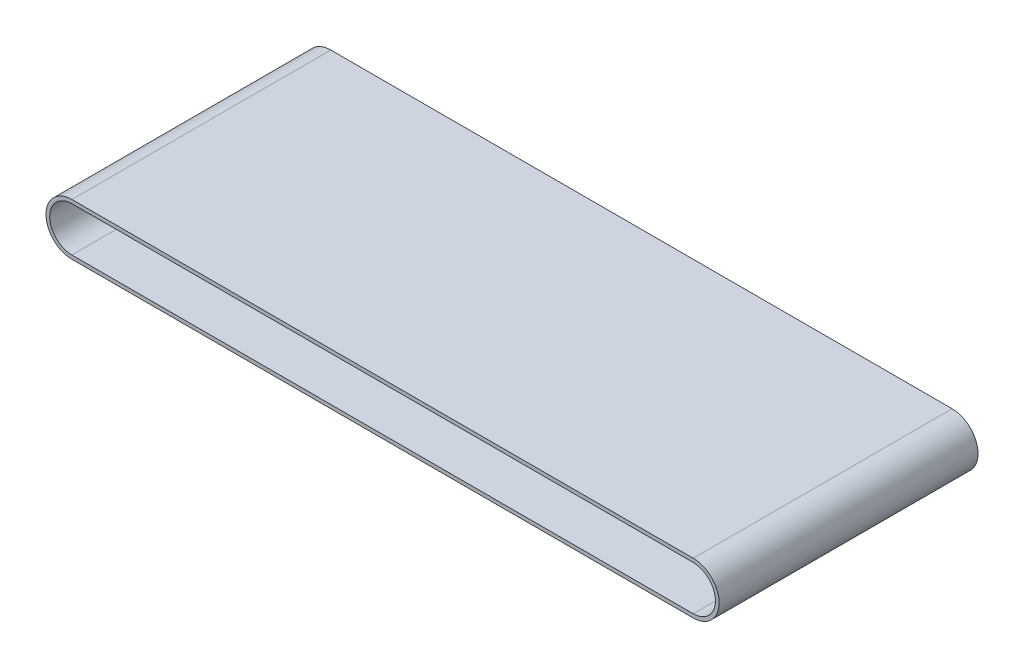
ISO-10303-21;
HEADER;
FILE_DESCRIPTION(('STEP AP214'),'2;1');
FILE_NAME('part.step','',(''),(''),'','','');
FILE_SCHEMA(('AUTOMOTIVE_DESIGN { 1 0 10303 214 1 1 1 1 }'));
ENDSEC;
DATA;
#1=APPLICATION_CONTEXT('core data for automotive mechanical design processes');
#2=APPLICATION_PROTOCOL_DEFINITION('international standard','automotive_design',2000,#1);
#3=PRODUCT_CONTEXT('',#1,'mechanical');
#4=PRODUCT('Part','Part','',(#3));
#5=PRODUCT_RELATED_PRODUCT_CATEGORY('part','',(#4));
#6=PRODUCT_DEFINITION_FORMATION('','',#4);
#7=PRODUCT_DEFINITION_CONTEXT('part definition',#1,'design');
#8=PRODUCT_DEFINITION('design','',#6,#7);
#9=PRODUCT_DEFINITION_SHAPE('','',#8);
#10=(LENGTH_UNIT() NAMED_UNIT(*) SI_UNIT(.MILLI.,.METRE.));
#11=(NAMED_UNIT(*) PLANE_ANGLE_UNIT() SI_UNIT($,.RADIAN.));
#12=(NAMED_UNIT(*) SI_UNIT($,.STERADIAN.) SOLID_ANGLE_UNIT());
#13=UNCERTAINTY_MEASURE_WITH_UNIT(LENGTH_MEASURE(1.E-05),#10,'distance_accuracy_value','');
#14=(GEOMETRIC_REPRESENTATION_CONTEXT(3) GLOBAL_UNCERTAINTY_ASSIGNED_CONTEXT((#13)) GLOBAL_UNIT_ASSIGNED_CONTEXT((#10,
#11,#12)) REPRESENTATION_CONTEXT('',''));
#15=CARTESIAN_POINT('',(0.,0.,0.));
#16=DIRECTION('',(0.,0.,1.));
#17=DIRECTION('',(1.,0.,0.));
#18=AXIS2_PLACEMENT_3D('',#15,#16,#17);
#19=CARTESIAN_POINT('',(0.,0.,222.25));
#20=DIRECTION('',(0.,0.,-1.));
#21=DIRECTION('',(-1.,0.,0.));
#22=AXIS2_PLACEMENT_3D('',#19,#20,#21);
#23=CYLINDRICAL_SURFACE('',#22,44.45);
#24=CARTESIAN_POINT('',(0.,0.,-222.25));
#25=DIRECTION('',(0.,0.,1.));
#26=DIRECTION('',(1.,0.,0.));
#27=AXIS2_PLACEMENT_3D('',#24,#25,#26);
#28=CIRCLE('',#27,44.45);
#29=CARTESIAN_POINT('',(0.,44.45,-222.25));
#30=VERTEX_POINT('',#29);
#31=CARTESIAN_POINT('',(0.,-44.45,-222.25));
#32=VERTEX_POINT('',#31);
#33=EDGE_CURVE('E153',#30,#32,#28,.T.);
#34=ORIENTED_EDGE('',*,*,#33,.T.);
#35=DIRECTION('',(0.,0.,-1.));
#36=VECTOR('',#35,1.);
#37=CARTESIAN_POINT('',(0.,-44.45,222.25));
#38=LINE('',#37,#36);
#39=CARTESIAN_POINT('',(0.,-44.45,222.25));
#40=VERTEX_POINT('',#39);
#41=EDGE_CURVE('E11',#40,#32,#38,.T.);
#42=ORIENTED_EDGE('',*,*,#41,.F.);
#43=CARTESIAN_POINT('',(0.,0.,222.25));
#44=DIRECTION('',(0.,0.,1.));
#45=DIRECTION('',(1.,0.,0.));
#46=AXIS2_PLACEMENT_3D('',#43,#44,#45);
#47=CIRCLE('',#46,44.45);
#48=CARTESIAN_POINT('',(0.,44.45,222.25));
#49=VERTEX_POINT('',#48);
#50=EDGE_CURVE('E159',#49,#40,#47,.T.);
#51=ORIENTED_EDGE('',*,*,#50,.F.);
#52=DIRECTION('',(0.,0.,-1.));
#53=VECTOR('',#52,1.);
#54=CARTESIAN_POINT('',(0.,44.45,222.25));
#55=LINE('',#54,#53);
#56=EDGE_CURVE('E173',#49,#30,#55,.T.);
#57=ORIENTED_EDGE('',*,*,#56,.T.);
#58=EDGE_LOOP('',(#34,#42,#51,#57));
#59=FACE_BOUND('',#58,.T.);
#60=ADVANCED_FACE('F45',(#59),#23,.T.);
#61=CARTESIAN_POINT('',(0.,-44.45,222.25));
#62=DIRECTION('',(0.,1.,0.));
#63=DIRECTION('',(0.,0.,1.));
#64=AXIS2_PLACEMENT_3D('',#61,#62,#63);
#65=PLANE('',#64);
#66=DIRECTION('',(1.,0.,0.));
#67=VECTOR('',#66,1.);
#68=CARTESIAN_POINT('',(0.,-44.45,-222.25));
#69=LINE('',#68,#67);
#70=CARTESIAN_POINT('',(1066.8,-44.45,-222.25));
#71=VERTEX_POINT('',#70);
#72=EDGE_CURVE('E177',#32,#71,#69,.T.);
#73=ORIENTED_EDGE('',*,*,#72,.T.);
#74=DIRECTION('',(0.,0.,-1.));
#75=VECTOR('',#74,1.);
#76=CARTESIAN_POINT('',(1066.8,-44.45,222.25));
#77=LINE('',#76,#75);
#78=CARTESIAN_POINT('',(1066.8,-44.45,222.25));
#79=VERTEX_POINT('',#78);
#80=EDGE_CURVE('E53',#79,#71,#77,.T.);
#81=ORIENTED_EDGE('',*,*,#80,.F.);
#82=DIRECTION('',(1.,0.,0.));
#83=VECTOR('',#82,1.);
#84=CARTESIAN_POINT('',(0.,-44.45,222.25));
#85=LINE('',#84,#83);
#86=EDGE_CURVE('E163',#40,#79,#85,.T.);
#87=ORIENTED_EDGE('',*,*,#86,.F.);
#88=ORIENTED_EDGE('',*,*,#41,.T.);
#89=EDGE_LOOP('',(#73,#81,#87,#88));
#90=FACE_BOUND('',#89,.T.);
#91=ADVANCED_FACE('F211',(#90),#65,.F.);
#92=CARTESIAN_POINT('',(1066.8,0.,222.25));
#93=DIRECTION('',(0.,0.,-1.));
#94=DIRECTION('',(-1.,0.,0.));
#95=AXIS2_PLACEMENT_3D('',#92,#93,#94);
#96=CYLINDRICAL_SURFACE('',#95,44.45);
#97=CARTESIAN_POINT('',(1066.8,0.,-222.25));
#98=DIRECTION('',(0.,0.,1.));
#99=DIRECTION('',(1.,0.,0.));
#100=AXIS2_PLACEMENT_3D('',#97,#98,#99);
#101=CIRCLE('',#100,44.45);
#102=CARTESIAN_POINT('',(1066.8,44.45,-222.25));
#103=VERTEX_POINT('',#102);
#104=EDGE_CURVE('E180',#71,#103,#101,.T.);
#105=ORIENTED_EDGE('',*,*,#104,.T.);
#106=DIRECTION('',(0.,0.,-1.));
#107=VECTOR('',#106,1.);
#108=CARTESIAN_POINT('',(1066.8,44.45,222.25));
#109=LINE('',#108,#107);
#110=CARTESIAN_POINT('',(1066.8,44.45,222.25));
#111=VERTEX_POINT('',#110);
#112=EDGE_CURVE('E188',#111,#103,#109,.T.);
#113=ORIENTED_EDGE('',*,*,#112,.F.);
#114=CARTESIAN_POINT('',(1066.8,0.,222.25));
#115=DIRECTION('',(0.,0.,1.));
#116=DIRECTION('',(1.,0.,0.));
#117=AXIS2_PLACEMENT_3D('',#114,#115,#116);
#118=CIRCLE('',#117,44.45);
#119=EDGE_CURVE('E167',#79,#111,#118,.T.);
#120=ORIENTED_EDGE('',*,*,#119,.F.);
#121=ORIENTED_EDGE('',*,*,#80,.T.);
#122=EDGE_LOOP('',(#105,#113,#120,#121));
#123=FACE_BOUND('',#122,.T.);
#124=ADVANCED_FACE('F197',(#123),#96,.T.);
#125=CARTESIAN_POINT('',(0.,44.45,222.25));
#126=DIRECTION('',(0.,-1.,0.));
#127=DIRECTION('',(0.,0.,-1.));
#128=AXIS2_PLACEMENT_3D('',#125,#126,#127);
#129=PLANE('',#128);
#130=DIRECTION('',(-1.,0.,0.));
#131=VECTOR('',#130,1.);
#132=CARTESIAN_POINT('',(0.,44.45,-222.25));
#133=LINE('',#132,#131);
#134=EDGE_CURVE('E164',#103,#30,#133,.T.);
#135=ORIENTED_EDGE('',*,*,#134,.T.);
#136=ORIENTED_EDGE('',*,*,#56,.F.);
#137=DIRECTION('',(-1.,0.,0.));
#138=VECTOR('',#137,1.);
#139=CARTESIAN_POINT('',(0.,44.45,222.25));
#140=LINE('',#139,#138);
#141=EDGE_CURVE('E170',#111,#49,#140,.T.);
#142=ORIENTED_EDGE('',*,*,#141,.F.);
#143=ORIENTED_EDGE('',*,*,#112,.T.);
#144=EDGE_LOOP('',(#135,#136,#142,#143));
#145=FACE_BOUND('',#144,.T.);
#146=ADVANCED_FACE('F206',(#145),#129,.F.);
#147=CARTESIAN_POINT('',(0.,0.,222.25));
#148=DIRECTION('',(0.,0.,1.));
#149=DIRECTION('',(1.,0.,0.));
#150=AXIS2_PLACEMENT_3D('',#147,#148,#149);
#151=PLANE('',#150);
#152=CARTESIAN_POINT('',(1066.8,-1.3064532053304E-13,222.25));
#153=DIRECTION('',(0.,0.,-1.));
#154=DIRECTION('',(-1.,0.,0.));
#155=AXIS2_PLACEMENT_3D('',#152,#153,#154);
#156=CIRCLE('',#155,38.1);
#157=CARTESIAN_POINT('',(1066.8,38.0999999999999,222.25));
#158=VERTEX_POINT('',#157);
#159=CARTESIAN_POINT('',(1066.8,-38.1000000000001,222.25));
#160=VERTEX_POINT('',#159);
#161=EDGE_CURVE('E112',#158,#160,#156,.T.);
#162=ORIENTED_EDGE('',*,*,#161,.T.);
#163=DIRECTION('',(-1.,0.,0.));
#164=VECTOR('',#163,1.);
#165=CARTESIAN_POINT('',(0.,-38.1,222.25));
#166=LINE('',#165,#164);
#167=CARTESIAN_POINT('',(0.,-38.1,222.25));
#168=VERTEX_POINT('',#167);
#169=EDGE_CURVE('E122',#160,#168,#166,.T.);
#170=ORIENTED_EDGE('',*,*,#169,.T.);
#171=CARTESIAN_POINT('',(0.,0.,222.25));
#172=DIRECTION('',(0.,0.,-1.));
#173=DIRECTION('',(-1.,0.,0.));
#174=AXIS2_PLACEMENT_3D('',#171,#172,#173);
#175=CIRCLE('',#174,38.1);
#176=CARTESIAN_POINT('',(0.,38.1,222.25));
#177=VERTEX_POINT('',#176);
#178=EDGE_CURVE('E60',#168,#177,#175,.T.);
#179=ORIENTED_EDGE('',*,*,#178,.T.);
#180=DIRECTION('',(1.,0.,0.));
#181=VECTOR('',#180,1.);
#182=CARTESIAN_POINT('',(1066.8,38.0999999999999,222.25));
#183=LINE('',#182,#181);
#184=EDGE_CURVE('E119',#177,#158,#183,.T.);
#185=ORIENTED_EDGE('',*,*,#184,.T.);
#186=EDGE_LOOP('',(#162,#170,#179,#185));
#187=FACE_BOUND('',#186,.T.);
#188=ORIENTED_EDGE('',*,*,#50,.T.);
#189=ORIENTED_EDGE('',*,*,#86,.T.);
#190=ORIENTED_EDGE('',*,*,#119,.T.);
#191=ORIENTED_EDGE('',*,*,#141,.T.);
#192=EDGE_LOOP('',(#188,#189,#190,#191));
#193=FACE_BOUND('',#192,.T.);
#194=ADVANCED_FACE('F127',(#187,#193),#151,.T.);
#195=CARTESIAN_POINT('',(0.,0.,-222.25));
#196=DIRECTION('',(0.,0.,1.));
#197=DIRECTION('',(1.,0.,0.));
#198=AXIS2_PLACEMENT_3D('',#195,#196,#197);
#199=PLANE('',#198);
#200=DIRECTION('',(-1.,0.,0.));
#201=VECTOR('',#200,1.);
#202=CARTESIAN_POINT('',(0.,-38.1,-222.25));
#203=LINE('',#202,#201);
#204=CARTESIAN_POINT('',(1066.8,-38.1000000000001,-222.25));
#205=VERTEX_POINT('',#204);
#206=CARTESIAN_POINT('',(0.,-38.1,-222.25));
#207=VERTEX_POINT('',#206);
#208=EDGE_CURVE('E144',#205,#207,#203,.T.);
#209=ORIENTED_EDGE('',*,*,#208,.F.);
#210=CARTESIAN_POINT('',(1066.8,-1.3064532053304E-13,-222.25));
#211=DIRECTION('',(0.,0.,-1.));
#212=DIRECTION('',(-1.,0.,0.));
#213=AXIS2_PLACEMENT_3D('',#210,#211,#212);
#214=CIRCLE('',#213,38.1);
#215=CARTESIAN_POINT('',(1066.8,38.0999999999999,-222.25));
#216=VERTEX_POINT('',#215);
#217=EDGE_CURVE('E68',#216,#205,#214,.T.);
#218=ORIENTED_EDGE('',*,*,#217,.F.);
#219=DIRECTION('',(1.,0.,0.));
#220=VECTOR('',#219,1.);
#221=CARTESIAN_POINT('',(1066.8,38.0999999999999,-222.25));
#222=LINE('',#221,#220);
#223=CARTESIAN_POINT('',(0.,38.1,-222.25));
#224=VERTEX_POINT('',#223);
#225=EDGE_CURVE('E131',#224,#216,#222,.T.);
#226=ORIENTED_EDGE('',*,*,#225,.F.);
#227=CARTESIAN_POINT('',(0.,0.,-222.25));
#228=DIRECTION('',(0.,0.,-1.));
#229=DIRECTION('',(-1.,0.,0.));
#230=AXIS2_PLACEMENT_3D('',#227,#228,#229);
#231=CIRCLE('',#230,38.1);
#232=EDGE_CURVE('E135',#207,#224,#231,.T.);
#233=ORIENTED_EDGE('',*,*,#232,.F.);
#234=EDGE_LOOP('',(#209,#218,#226,#233));
#235=FACE_BOUND('',#234,.T.);
#236=ORIENTED_EDGE('',*,*,#33,.F.);
#237=ORIENTED_EDGE('',*,*,#134,.F.);
#238=ORIENTED_EDGE('',*,*,#104,.F.);
#239=ORIENTED_EDGE('',*,*,#72,.F.);
#240=EDGE_LOOP('',(#236,#237,#238,#239));
#241=FACE_BOUND('',#240,.T.);
#242=ADVANCED_FACE('F203',(#235,#241),#199,.F.);
#243=CARTESIAN_POINT('',(1066.8,-1.3064532053304E-13,222.25));
#244=DIRECTION('',(0.,0.,-1.));
#245=DIRECTION('',(-1.,0.,0.));
#246=AXIS2_PLACEMENT_3D('',#243,#244,#245);
#247=CYLINDRICAL_SURFACE('',#246,38.1);
#248=ORIENTED_EDGE('',*,*,#217,.T.);
#249=DIRECTION('',(0.,0.,-1.));
#250=VECTOR('',#249,1.);
#251=CARTESIAN_POINT('',(1066.8,-38.1000000000001,222.25));
#252=LINE('',#251,#250);
#253=EDGE_CURVE('E108',#160,#205,#252,.T.);
#254=ORIENTED_EDGE('',*,*,#253,.F.);
#255=ORIENTED_EDGE('',*,*,#161,.F.);
#256=DIRECTION('',(0.,0.,-1.));
#257=VECTOR('',#256,1.);
#258=CARTESIAN_POINT('',(1066.8,38.0999999999999,222.25));
#259=LINE('',#258,#257);
#260=EDGE_CURVE('E150',#158,#216,#259,.T.);
#261=ORIENTED_EDGE('',*,*,#260,.T.);
#262=EDGE_LOOP('',(#248,#254,#255,#261));
#263=FACE_BOUND('',#262,.T.);
#264=ADVANCED_FACE('F110',(#263),#247,.F.);
#265=CARTESIAN_POINT('',(1066.8,38.0999999999999,222.25));
#266=DIRECTION('',(0.,1.,0.));
#267=DIRECTION('',(-1.,0.,0.));
#268=AXIS2_PLACEMENT_3D('',#265,#266,#267);
#269=PLANE('',#268);
#270=ORIENTED_EDGE('',*,*,#225,.T.);
#271=ORIENTED_EDGE('',*,*,#260,.F.);
#272=ORIENTED_EDGE('',*,*,#184,.F.);
#273=DIRECTION('',(0.,0.,-1.));
#274=VECTOR('',#273,1.);
#275=CARTESIAN_POINT('',(0.,38.1,222.25));
#276=LINE('',#275,#274);
#277=EDGE_CURVE('E154',#177,#224,#276,.T.);
#278=ORIENTED_EDGE('',*,*,#277,.T.);
#279=EDGE_LOOP('',(#270,#271,#272,#278));
#280=FACE_BOUND('',#279,.T.);
#281=ADVANCED_FACE('F228',(#280),#269,.F.);
#282=CARTESIAN_POINT('',(0.,0.,222.25));
#283=DIRECTION('',(0.,0.,-1.));
#284=DIRECTION('',(-1.,0.,0.));
#285=AXIS2_PLACEMENT_3D('',#282,#283,#284);
#286=CYLINDRICAL_SURFACE('',#285,38.1);
#287=ORIENTED_EDGE('',*,*,#232,.T.);
#288=ORIENTED_EDGE('',*,*,#277,.F.);
#289=ORIENTED_EDGE('',*,*,#178,.F.);
#290=DIRECTION('',(0.,0.,-1.));
#291=VECTOR('',#290,1.);
#292=CARTESIAN_POINT('',(0.,-38.1,222.25));
#293=LINE('',#292,#291);
#294=EDGE_CURVE('E118',#168,#207,#293,.T.);
#295=ORIENTED_EDGE('',*,*,#294,.T.);
#296=EDGE_LOOP('',(#287,#288,#289,#295));
#297=FACE_BOUND('',#296,.T.);
#298=ADVANCED_FACE('F231',(#297),#286,.F.);
#299=CARTESIAN_POINT('',(0.,-38.1,222.25));
#300=DIRECTION('',(0.,-1.,0.));
#301=DIRECTION('',(1.,0.,0.));
#302=AXIS2_PLACEMENT_3D('',#299,#300,#301);
#303=PLANE('',#302);
#304=ORIENTED_EDGE('',*,*,#208,.T.);
#305=ORIENTED_EDGE('',*,*,#294,.F.);
#306=ORIENTED_EDGE('',*,*,#169,.F.);
#307=ORIENTED_EDGE('',*,*,#253,.T.);
#308=EDGE_LOOP('',(#304,#305,#306,#307));
#309=FACE_BOUND('',#308,.T.);
#310=ADVANCED_FACE('F123',(#309),#303,.F.);
#311=CLOSED_SHELL('',(#60,#91,#124,#146,#194,#242,#264,#281,#298,#310));
#312=MANIFOLD_SOLID_BREP('B2',#311);
#313=ADVANCED_BREP_SHAPE_REPRESENTATION('',(#18,#312),#14);
#314=SHAPE_DEFINITION_REPRESENTATION(#9,#313);
ENDSEC;
END-ISO-10303-21;
